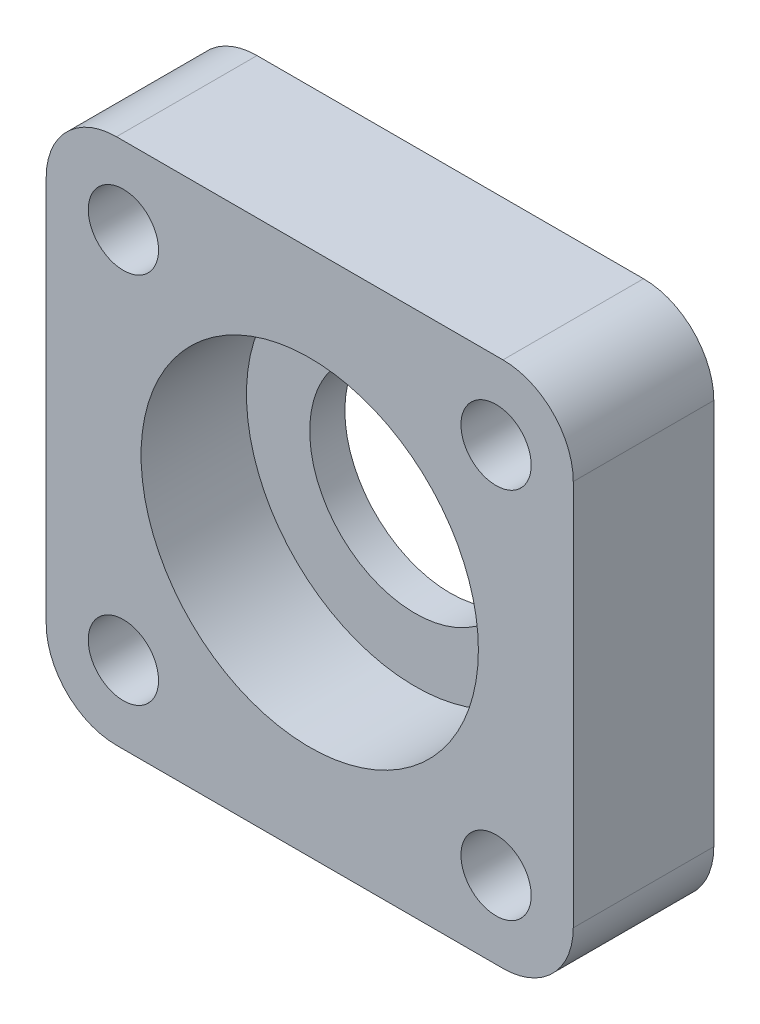
ISO-10303-21;
HEADER;
FILE_DESCRIPTION(('STEP AP214'),'2;1');
FILE_NAME('part.step','',(''),(''),'','','');
FILE_SCHEMA(('AUTOMOTIVE_DESIGN { 1 0 10303 214 1 1 1 1 }'));
ENDSEC;
DATA;
#1=APPLICATION_CONTEXT('core data for automotive mechanical design processes');
#2=APPLICATION_PROTOCOL_DEFINITION('international standard','automotive_design',2000,#1);
#3=PRODUCT_CONTEXT('',#1,'mechanical');
#4=PRODUCT('Part','Part','',(#3));
#5=PRODUCT_RELATED_PRODUCT_CATEGORY('part','',(#4));
#6=PRODUCT_DEFINITION_FORMATION('','',#4);
#7=PRODUCT_DEFINITION_CONTEXT('part definition',#1,'design');
#8=PRODUCT_DEFINITION('design','',#6,#7);
#9=PRODUCT_DEFINITION_SHAPE('','',#8);
#10=(LENGTH_UNIT() NAMED_UNIT(*) SI_UNIT(.MILLI.,.METRE.));
#11=(NAMED_UNIT(*) PLANE_ANGLE_UNIT() SI_UNIT($,.RADIAN.));
#12=(NAMED_UNIT(*) SI_UNIT($,.STERADIAN.) SOLID_ANGLE_UNIT());
#13=UNCERTAINTY_MEASURE_WITH_UNIT(LENGTH_MEASURE(1.E-05),#10,'distance_accuracy_value','');
#14=(GEOMETRIC_REPRESENTATION_CONTEXT(3) GLOBAL_UNCERTAINTY_ASSIGNED_CONTEXT((#13)) GLOBAL_UNIT_ASSIGNED_CONTEXT((#10,
#11,#12)) REPRESENTATION_CONTEXT('',''));
#15=CARTESIAN_POINT('',(0.,0.,0.));
#16=DIRECTION('',(0.,0.,1.));
#17=DIRECTION('',(1.,0.,0.));
#18=AXIS2_PLACEMENT_3D('',#15,#16,#17);
#19=CARTESIAN_POINT('',(0.,0.,8.));
#20=DIRECTION('',(0.,0.,-1.));
#21=DIRECTION('',(-1.,0.,0.));
#22=AXIS2_PLACEMENT_3D('',#19,#20,#21);
#23=PLANE('',#22);
#24=CARTESIAN_POINT('',(15.,15.,8.));
#25=DIRECTION('',(0.,0.,1.));
#26=DIRECTION('',(1.,0.,0.));
#27=AXIS2_PLACEMENT_3D('',#24,#25,#26);
#28=CIRCLE('',#27,9.6);
#29=CARTESIAN_POINT('',(24.6,15.,8.));
#30=VERTEX_POINT('',#29);
#31=EDGE_CURVE('E148',#30,#30,#28,.T.);
#32=ORIENTED_EDGE('',*,*,#31,.F.);
#33=EDGE_LOOP('',(#32));
#34=FACE_BOUND('',#33,.T.);
#35=DIRECTION('',(0.,-1.,0.));
#36=VECTOR('',#35,1.);
#37=CARTESIAN_POINT('',(0.,0.,8.));
#38=LINE('',#37,#36);
#39=CARTESIAN_POINT('',(0.,26.,8.));
#40=VERTEX_POINT('',#39);
#41=CARTESIAN_POINT('',(0.,4.,8.));
#42=VERTEX_POINT('',#41);
#43=EDGE_CURVE('E144',#40,#42,#38,.T.);
#44=ORIENTED_EDGE('',*,*,#43,.T.);
#45=CARTESIAN_POINT('',(4.,4.,8.));
#46=DIRECTION('',(0.,0.,-1.));
#47=DIRECTION('',(-1.,0.,0.));
#48=AXIS2_PLACEMENT_3D('',#45,#46,#47);
#49=CIRCLE('',#48,4.);
#50=CARTESIAN_POINT('',(4.,0.,8.));
#51=VERTEX_POINT('',#50);
#52=EDGE_CURVE('E164',#42,#51,#49,.F.);
#53=ORIENTED_EDGE('',*,*,#52,.T.);
#54=DIRECTION('',(1.,0.,0.));
#55=VECTOR('',#54,1.);
#56=CARTESIAN_POINT('',(0.,0.,8.));
#57=LINE('',#56,#55);
#58=CARTESIAN_POINT('',(26.,0.,8.));
#59=VERTEX_POINT('',#58);
#60=EDGE_CURVE('E126',#51,#59,#57,.T.);
#61=ORIENTED_EDGE('',*,*,#60,.T.);
#62=CARTESIAN_POINT('',(26.,4.,8.));
#63=DIRECTION('',(0.,0.,-1.));
#64=DIRECTION('',(-1.,0.,0.));
#65=AXIS2_PLACEMENT_3D('',#62,#63,#64);
#66=CIRCLE('',#65,4.);
#67=CARTESIAN_POINT('',(30.,4.,8.));
#68=VERTEX_POINT('',#67);
#69=EDGE_CURVE('E162',#59,#68,#66,.F.);
#70=ORIENTED_EDGE('',*,*,#69,.T.);
#71=DIRECTION('',(0.,1.,0.));
#72=VECTOR('',#71,1.);
#73=CARTESIAN_POINT('',(30.,0.,8.));
#74=LINE('',#73,#72);
#75=CARTESIAN_POINT('',(30.,26.,8.));
#76=VERTEX_POINT('',#75);
#77=EDGE_CURVE('E184',#68,#76,#74,.T.);
#78=ORIENTED_EDGE('',*,*,#77,.T.);
#79=CARTESIAN_POINT('',(26.,26.,8.));
#80=DIRECTION('',(0.,0.,-1.));
#81=DIRECTION('',(-1.,0.,0.));
#82=AXIS2_PLACEMENT_3D('',#79,#80,#81);
#83=CIRCLE('',#82,4.);
#84=CARTESIAN_POINT('',(26.,30.,8.));
#85=VERTEX_POINT('',#84);
#86=EDGE_CURVE('E61',#76,#85,#83,.F.);
#87=ORIENTED_EDGE('',*,*,#86,.T.);
#88=DIRECTION('',(-1.,0.,0.));
#89=VECTOR('',#88,1.);
#90=CARTESIAN_POINT('',(0.,30.,8.));
#91=LINE('',#90,#89);
#92=CARTESIAN_POINT('',(4.,30.,8.));
#93=VERTEX_POINT('',#92);
#94=EDGE_CURVE('E150',#85,#93,#91,.T.);
#95=ORIENTED_EDGE('',*,*,#94,.T.);
#96=CARTESIAN_POINT('',(4.,26.,8.));
#97=DIRECTION('',(0.,0.,-1.));
#98=DIRECTION('',(-1.,0.,0.));
#99=AXIS2_PLACEMENT_3D('',#96,#97,#98);
#100=CIRCLE('',#99,4.);
#101=EDGE_CURVE('E160',#93,#40,#100,.F.);
#102=ORIENTED_EDGE('',*,*,#101,.T.);
#103=EDGE_LOOP('',(#44,#53,#61,#70,#78,#87,#95,#102));
#104=FACE_BOUND('',#103,.T.);
#105=CARTESIAN_POINT('',(25.6066017177982,25.6066017177982,8.));
#106=DIRECTION('',(0.,0.,1.));
#107=DIRECTION('',(1.,0.,0.));
#108=AXIS2_PLACEMENT_3D('',#105,#106,#107);
#109=CIRCLE('',#108,2.);
#110=CARTESIAN_POINT('',(27.6066017177982,25.6066017177982,8.));
#111=VERTEX_POINT('',#110);
#112=EDGE_CURVE('E139',#111,#111,#109,.T.);
#113=ORIENTED_EDGE('',*,*,#112,.F.);
#114=EDGE_LOOP('',(#113));
#115=FACE_BOUND('',#114,.T.);
#116=CARTESIAN_POINT('',(25.6066017177982,4.39339828220181,8.));
#117=DIRECTION('',(0.,0.,1.));
#118=DIRECTION('',(1.,0.,0.));
#119=AXIS2_PLACEMENT_3D('',#116,#117,#118);
#120=CIRCLE('',#119,2.);
#121=CARTESIAN_POINT('',(27.6066017177982,4.39339828220181,8.));
#122=VERTEX_POINT('',#121);
#123=EDGE_CURVE('E200',#122,#122,#120,.T.);
#124=ORIENTED_EDGE('',*,*,#123,.F.);
#125=EDGE_LOOP('',(#124));
#126=FACE_BOUND('',#125,.T.);
#127=CARTESIAN_POINT('',(4.39339828220181,4.39339828220177,8.));
#128=DIRECTION('',(0.,0.,1.));
#129=DIRECTION('',(1.,0.,0.));
#130=AXIS2_PLACEMENT_3D('',#127,#128,#129);
#131=CIRCLE('',#130,2.00000000000001);
#132=CARTESIAN_POINT('',(6.39339828220182,4.39339828220177,8.));
#133=VERTEX_POINT('',#132);
#134=EDGE_CURVE('E204',#133,#133,#131,.T.);
#135=ORIENTED_EDGE('',*,*,#134,.F.);
#136=EDGE_LOOP('',(#135));
#137=FACE_BOUND('',#136,.T.);
#138=CARTESIAN_POINT('',(4.39339828220177,25.6066017177982,8.));
#139=DIRECTION('',(0.,0.,1.));
#140=DIRECTION('',(1.,0.,0.));
#141=AXIS2_PLACEMENT_3D('',#138,#139,#140);
#142=CIRCLE('',#141,2.00000000000001);
#143=CARTESIAN_POINT('',(6.39339828220178,25.6066017177982,8.));
#144=VERTEX_POINT('',#143);
#145=EDGE_CURVE('E207',#144,#144,#142,.T.);
#146=ORIENTED_EDGE('',*,*,#145,.F.);
#147=EDGE_LOOP('',(#146));
#148=FACE_BOUND('',#147,.T.);
#149=ADVANCED_FACE('F41',(#34,#104,#115,#126,#137,#148),#23,.F.);
#150=CARTESIAN_POINT('',(0.,0.,0.));
#151=DIRECTION('',(0.,0.,-1.));
#152=DIRECTION('',(-1.,0.,0.));
#153=AXIS2_PLACEMENT_3D('',#150,#151,#152);
#154=PLANE('',#153);
#155=CARTESIAN_POINT('',(15.,15.,0.));
#156=DIRECTION('',(0.,0.,-1.));
#157=DIRECTION('',(-1.,0.,0.));
#158=AXIS2_PLACEMENT_3D('',#155,#156,#157);
#159=CIRCLE('',#158,6.);
#160=CARTESIAN_POINT('',(9.,15.,0.));
#161=VERTEX_POINT('',#160);
#162=EDGE_CURVE('E145',#161,#161,#159,.T.);
#163=ORIENTED_EDGE('',*,*,#162,.F.);
#164=EDGE_LOOP('',(#163));
#165=FACE_BOUND('',#164,.T.);
#166=CARTESIAN_POINT('',(4.39339828220181,4.39339828220177,0.));
#167=DIRECTION('',(0.,0.,1.));
#168=DIRECTION('',(1.,0.,0.));
#169=AXIS2_PLACEMENT_3D('',#166,#167,#168);
#170=CIRCLE('',#169,2.00000000000001);
#171=CARTESIAN_POINT('',(6.39339828220182,4.39339828220177,0.));
#172=VERTEX_POINT('',#171);
#173=EDGE_CURVE('E209',#172,#172,#170,.T.);
#174=ORIENTED_EDGE('',*,*,#173,.T.);
#175=EDGE_LOOP('',(#174));
#176=FACE_BOUND('',#175,.T.);
#177=CARTESIAN_POINT('',(25.6066017177982,25.6066017177982,0.));
#178=DIRECTION('',(0.,0.,1.));
#179=DIRECTION('',(1.,0.,0.));
#180=AXIS2_PLACEMENT_3D('',#177,#178,#179);
#181=CIRCLE('',#180,2.);
#182=CARTESIAN_POINT('',(27.6066017177982,25.6066017177982,0.));
#183=VERTEX_POINT('',#182);
#184=EDGE_CURVE('E187',#183,#183,#181,.T.);
#185=ORIENTED_EDGE('',*,*,#184,.T.);
#186=EDGE_LOOP('',(#185));
#187=FACE_BOUND('',#186,.T.);
#188=DIRECTION('',(1.,0.,0.));
#189=VECTOR('',#188,1.);
#190=CARTESIAN_POINT('',(0.,0.,0.));
#191=LINE('',#190,#189);
#192=CARTESIAN_POINT('',(4.,0.,0.));
#193=VERTEX_POINT('',#192);
#194=CARTESIAN_POINT('',(26.,0.,0.));
#195=VERTEX_POINT('',#194);
#196=EDGE_CURVE('E123',#193,#195,#191,.T.);
#197=ORIENTED_EDGE('',*,*,#196,.F.);
#198=CARTESIAN_POINT('',(4.,4.,0.));
#199=DIRECTION('',(0.,0.,-1.));
#200=DIRECTION('',(-1.,0.,0.));
#201=AXIS2_PLACEMENT_3D('',#198,#199,#200);
#202=CIRCLE('',#201,4.);
#203=CARTESIAN_POINT('',(0.,4.,0.));
#204=VERTEX_POINT('',#203);
#205=EDGE_CURVE('E106',#193,#204,#202,.T.);
#206=ORIENTED_EDGE('',*,*,#205,.T.);
#207=DIRECTION('',(0.,-1.,0.));
#208=VECTOR('',#207,1.);
#209=CARTESIAN_POINT('',(0.,0.,0.));
#210=LINE('',#209,#208);
#211=CARTESIAN_POINT('',(0.,26.,0.));
#212=VERTEX_POINT('',#211);
#213=EDGE_CURVE('E134',#212,#204,#210,.T.);
#214=ORIENTED_EDGE('',*,*,#213,.F.);
#215=CARTESIAN_POINT('',(4.,26.,0.));
#216=DIRECTION('',(0.,0.,-1.));
#217=DIRECTION('',(-1.,0.,0.));
#218=AXIS2_PLACEMENT_3D('',#215,#216,#217);
#219=CIRCLE('',#218,4.);
#220=CARTESIAN_POINT('',(4.,30.,0.));
#221=VERTEX_POINT('',#220);
#222=EDGE_CURVE('E153',#212,#221,#219,.T.);
#223=ORIENTED_EDGE('',*,*,#222,.T.);
#224=DIRECTION('',(-1.,0.,0.));
#225=VECTOR('',#224,1.);
#226=CARTESIAN_POINT('',(0.,30.,0.));
#227=LINE('',#226,#225);
#228=CARTESIAN_POINT('',(26.,30.,0.));
#229=VERTEX_POINT('',#228);
#230=EDGE_CURVE('E137',#229,#221,#227,.T.);
#231=ORIENTED_EDGE('',*,*,#230,.F.);
#232=CARTESIAN_POINT('',(26.,26.,0.));
#233=DIRECTION('',(0.,0.,-1.));
#234=DIRECTION('',(-1.,0.,0.));
#235=AXIS2_PLACEMENT_3D('',#232,#233,#234);
#236=CIRCLE('',#235,4.);
#237=CARTESIAN_POINT('',(30.,26.,0.));
#238=VERTEX_POINT('',#237);
#239=EDGE_CURVE('E127',#229,#238,#236,.T.);
#240=ORIENTED_EDGE('',*,*,#239,.T.);
#241=DIRECTION('',(0.,1.,0.));
#242=VECTOR('',#241,1.);
#243=CARTESIAN_POINT('',(30.,0.,0.));
#244=LINE('',#243,#242);
#245=CARTESIAN_POINT('',(30.,4.,0.));
#246=VERTEX_POINT('',#245);
#247=EDGE_CURVE('E133',#246,#238,#244,.T.);
#248=ORIENTED_EDGE('',*,*,#247,.F.);
#249=CARTESIAN_POINT('',(26.,4.,0.));
#250=DIRECTION('',(0.,0.,-1.));
#251=DIRECTION('',(-1.,0.,0.));
#252=AXIS2_PLACEMENT_3D('',#249,#250,#251);
#253=CIRCLE('',#252,4.);
#254=EDGE_CURVE('E117',#246,#195,#253,.T.);
#255=ORIENTED_EDGE('',*,*,#254,.T.);
#256=EDGE_LOOP('',(#197,#206,#214,#223,#231,#240,#248,#255));
#257=FACE_BOUND('',#256,.T.);
#258=CARTESIAN_POINT('',(25.6066017177982,4.39339828220181,0.));
#259=DIRECTION('',(0.,0.,1.));
#260=DIRECTION('',(1.,0.,0.));
#261=AXIS2_PLACEMENT_3D('',#258,#259,#260);
#262=CIRCLE('',#261,2.);
#263=CARTESIAN_POINT('',(27.6066017177982,4.39339828220181,0.));
#264=VERTEX_POINT('',#263);
#265=EDGE_CURVE('E220',#264,#264,#262,.T.);
#266=ORIENTED_EDGE('',*,*,#265,.T.);
#267=EDGE_LOOP('',(#266));
#268=FACE_BOUND('',#267,.T.);
#269=CARTESIAN_POINT('',(4.39339828220177,25.6066017177982,0.));
#270=DIRECTION('',(0.,0.,1.));
#271=DIRECTION('',(1.,0.,0.));
#272=AXIS2_PLACEMENT_3D('',#269,#270,#271);
#273=CIRCLE('',#272,2.00000000000001);
#274=CARTESIAN_POINT('',(6.39339828220178,25.6066017177982,0.));
#275=VERTEX_POINT('',#274);
#276=EDGE_CURVE('E210',#275,#275,#273,.T.);
#277=ORIENTED_EDGE('',*,*,#276,.T.);
#278=EDGE_LOOP('',(#277));
#279=FACE_BOUND('',#278,.T.);
#280=ADVANCED_FACE('F130',(#165,#176,#187,#257,#268,#279),#154,.T.);
#281=CARTESIAN_POINT('',(0.,0.,8.));
#282=DIRECTION('',(1.,0.,0.));
#283=DIRECTION('',(0.,0.,-1.));
#284=AXIS2_PLACEMENT_3D('',#281,#282,#283);
#285=PLANE('',#284);
#286=ORIENTED_EDGE('',*,*,#213,.T.);
#287=DIRECTION('',(0.,0.,-1.));
#288=VECTOR('',#287,1.);
#289=CARTESIAN_POINT('',(0.,4.,8.));
#290=LINE('',#289,#288);
#291=EDGE_CURVE('E111',#204,#42,#290,.F.);
#292=ORIENTED_EDGE('',*,*,#291,.T.);
#293=ORIENTED_EDGE('',*,*,#43,.F.);
#294=DIRECTION('',(0.,0.,-1.));
#295=VECTOR('',#294,1.);
#296=CARTESIAN_POINT('',(0.,26.,8.));
#297=LINE('',#296,#295);
#298=EDGE_CURVE('E116',#40,#212,#297,.T.);
#299=ORIENTED_EDGE('',*,*,#298,.T.);
#300=EDGE_LOOP('',(#286,#292,#293,#299));
#301=FACE_BOUND('',#300,.T.);
#302=ADVANCED_FACE('F181',(#301),#285,.F.);
#303=CARTESIAN_POINT('',(0.,0.,8.));
#304=DIRECTION('',(0.,1.,0.));
#305=DIRECTION('',(0.,0.,1.));
#306=AXIS2_PLACEMENT_3D('',#303,#304,#305);
#307=PLANE('',#306);
#308=ORIENTED_EDGE('',*,*,#60,.F.);
#309=DIRECTION('',(0.,0.,-1.));
#310=VECTOR('',#309,1.);
#311=CARTESIAN_POINT('',(4.,0.,8.));
#312=LINE('',#311,#310);
#313=EDGE_CURVE('E110',#51,#193,#312,.T.);
#314=ORIENTED_EDGE('',*,*,#313,.T.);
#315=ORIENTED_EDGE('',*,*,#196,.T.);
#316=DIRECTION('',(0.,0.,-1.));
#317=VECTOR('',#316,1.);
#318=CARTESIAN_POINT('',(26.,0.,8.));
#319=LINE('',#318,#317);
#320=EDGE_CURVE('E128',#195,#59,#319,.F.);
#321=ORIENTED_EDGE('',*,*,#320,.T.);
#322=EDGE_LOOP('',(#308,#314,#315,#321));
#323=FACE_BOUND('',#322,.T.);
#324=ADVANCED_FACE('F122',(#323),#307,.F.);
#325=CARTESIAN_POINT('',(30.,0.,8.));
#326=DIRECTION('',(-1.,0.,0.));
#327=DIRECTION('',(0.,0.,1.));
#328=AXIS2_PLACEMENT_3D('',#325,#326,#327);
#329=PLANE('',#328);
#330=ORIENTED_EDGE('',*,*,#77,.F.);
#331=DIRECTION('',(0.,0.,-1.));
#332=VECTOR('',#331,1.);
#333=CARTESIAN_POINT('',(30.,4.,8.));
#334=LINE('',#333,#332);
#335=EDGE_CURVE('E168',#68,#246,#334,.T.);
#336=ORIENTED_EDGE('',*,*,#335,.T.);
#337=ORIENTED_EDGE('',*,*,#247,.T.);
#338=DIRECTION('',(0.,0.,-1.));
#339=VECTOR('',#338,1.);
#340=CARTESIAN_POINT('',(30.,26.,8.));
#341=LINE('',#340,#339);
#342=EDGE_CURVE('E166',#238,#76,#341,.F.);
#343=ORIENTED_EDGE('',*,*,#342,.T.);
#344=EDGE_LOOP('',(#330,#336,#337,#343));
#345=FACE_BOUND('',#344,.T.);
#346=ADVANCED_FACE('F240',(#345),#329,.F.);
#347=CARTESIAN_POINT('',(0.,30.,8.));
#348=DIRECTION('',(0.,-1.,0.));
#349=DIRECTION('',(0.,0.,-1.));
#350=AXIS2_PLACEMENT_3D('',#347,#348,#349);
#351=PLANE('',#350);
#352=ORIENTED_EDGE('',*,*,#230,.T.);
#353=DIRECTION('',(0.,0.,-1.));
#354=VECTOR('',#353,1.);
#355=CARTESIAN_POINT('',(4.,30.,8.));
#356=LINE('',#355,#354);
#357=EDGE_CURVE('E11',#221,#93,#356,.F.);
#358=ORIENTED_EDGE('',*,*,#357,.T.);
#359=ORIENTED_EDGE('',*,*,#94,.F.);
#360=DIRECTION('',(0.,0.,-1.));
#361=VECTOR('',#360,1.);
#362=CARTESIAN_POINT('',(26.,30.,8.));
#363=LINE('',#362,#361);
#364=EDGE_CURVE('E49',#85,#229,#363,.T.);
#365=ORIENTED_EDGE('',*,*,#364,.T.);
#366=EDGE_LOOP('',(#352,#358,#359,#365));
#367=FACE_BOUND('',#366,.T.);
#368=ADVANCED_FACE('F173',(#367),#351,.F.);
#369=CARTESIAN_POINT('',(25.6066017177982,25.6066017177982,8.));
#370=DIRECTION('',(0.,0.,-1.));
#371=DIRECTION('',(-1.,0.,0.));
#372=AXIS2_PLACEMENT_3D('',#369,#370,#371);
#373=CYLINDRICAL_SURFACE('',#372,2.);
#374=ORIENTED_EDGE('',*,*,#112,.T.);
#375=EDGE_LOOP('',(#374));
#376=FACE_BOUND('',#375,.T.);
#377=ORIENTED_EDGE('',*,*,#184,.F.);
#378=EDGE_LOOP('',(#377));
#379=FACE_BOUND('',#378,.T.);
#380=ADVANCED_FACE('F229',(#376,#379),#373,.F.);
#381=CARTESIAN_POINT('',(25.6066017177982,4.39339828220181,8.));
#382=DIRECTION('',(0.,0.,-1.));
#383=DIRECTION('',(-1.,0.,0.));
#384=AXIS2_PLACEMENT_3D('',#381,#382,#383);
#385=CYLINDRICAL_SURFACE('',#384,2.);
#386=ORIENTED_EDGE('',*,*,#123,.T.);
#387=EDGE_LOOP('',(#386));
#388=FACE_BOUND('',#387,.T.);
#389=ORIENTED_EDGE('',*,*,#265,.F.);
#390=EDGE_LOOP('',(#389));
#391=FACE_BOUND('',#390,.T.);
#392=ADVANCED_FACE('F231',(#388,#391),#385,.F.);
#393=CARTESIAN_POINT('',(4.39339828220181,4.39339828220177,8.));
#394=DIRECTION('',(0.,0.,-1.));
#395=DIRECTION('',(-1.,0.,0.));
#396=AXIS2_PLACEMENT_3D('',#393,#394,#395);
#397=CYLINDRICAL_SURFACE('',#396,2.00000000000001);
#398=ORIENTED_EDGE('',*,*,#134,.T.);
#399=EDGE_LOOP('',(#398));
#400=FACE_BOUND('',#399,.T.);
#401=ORIENTED_EDGE('',*,*,#173,.F.);
#402=EDGE_LOOP('',(#401));
#403=FACE_BOUND('',#402,.T.);
#404=ADVANCED_FACE('F237',(#400,#403),#397,.F.);
#405=CARTESIAN_POINT('',(4.39339828220177,25.6066017177982,8.));
#406=DIRECTION('',(0.,0.,-1.));
#407=DIRECTION('',(-1.,0.,0.));
#408=AXIS2_PLACEMENT_3D('',#405,#406,#407);
#409=CYLINDRICAL_SURFACE('',#408,2.00000000000001);
#410=ORIENTED_EDGE('',*,*,#145,.T.);
#411=EDGE_LOOP('',(#410));
#412=FACE_BOUND('',#411,.T.);
#413=ORIENTED_EDGE('',*,*,#276,.F.);
#414=EDGE_LOOP('',(#413));
#415=FACE_BOUND('',#414,.T.);
#416=ADVANCED_FACE('F364',(#412,#415),#409,.F.);
#417=CARTESIAN_POINT('',(15.,15.,2.));
#418=DIRECTION('',(0.,0.,1.));
#419=DIRECTION('',(1.,0.,0.));
#420=AXIS2_PLACEMENT_3D('',#417,#418,#419);
#421=CYLINDRICAL_SURFACE('',#420,9.6);
#422=CARTESIAN_POINT('',(15.,15.,2.));
#423=DIRECTION('',(0.,0.,1.));
#424=DIRECTION('',(1.,0.,0.));
#425=AXIS2_PLACEMENT_3D('',#422,#423,#424);
#426=CIRCLE('',#425,9.6);
#427=CARTESIAN_POINT('',(24.6,15.,2.));
#428=VERTEX_POINT('',#427);
#429=EDGE_CURVE('E215',#428,#428,#426,.T.);
#430=ORIENTED_EDGE('',*,*,#429,.F.);
#431=EDGE_LOOP('',(#430));
#432=FACE_BOUND('',#431,.T.);
#433=ORIENTED_EDGE('',*,*,#31,.T.);
#434=EDGE_LOOP('',(#433));
#435=FACE_BOUND('',#434,.T.);
#436=ADVANCED_FACE('F353',(#432,#435),#421,.F.);
#437=CARTESIAN_POINT('',(15.,15.,2.));
#438=DIRECTION('',(0.,0.,1.));
#439=DIRECTION('',(1.,0.,0.));
#440=AXIS2_PLACEMENT_3D('',#437,#438,#439);
#441=PLANE('',#440);
#442=CARTESIAN_POINT('',(15.,15.,2.));
#443=DIRECTION('',(0.,0.,1.));
#444=DIRECTION('',(1.,0.,0.));
#445=AXIS2_PLACEMENT_3D('',#442,#443,#444);
#446=CIRCLE('',#445,6.);
#447=CARTESIAN_POINT('',(21.,15.,2.));
#448=VERTEX_POINT('',#447);
#449=EDGE_CURVE('E149',#448,#448,#446,.T.);
#450=ORIENTED_EDGE('',*,*,#449,.F.);
#451=EDGE_LOOP('',(#450));
#452=FACE_BOUND('',#451,.T.);
#453=ORIENTED_EDGE('',*,*,#429,.T.);
#454=EDGE_LOOP('',(#453));
#455=FACE_BOUND('',#454,.T.);
#456=ADVANCED_FACE('F342',(#452,#455),#441,.T.);
#457=CARTESIAN_POINT('',(15.,15.,-5.));
#458=DIRECTION('',(0.,0.,1.));
#459=DIRECTION('',(1.,0.,0.));
#460=AXIS2_PLACEMENT_3D('',#457,#458,#459);
#461=CYLINDRICAL_SURFACE('',#460,6.);
#462=ORIENTED_EDGE('',*,*,#162,.T.);
#463=EDGE_LOOP('',(#462));
#464=FACE_BOUND('',#463,.T.);
#465=ORIENTED_EDGE('',*,*,#449,.T.);
#466=EDGE_LOOP('',(#465));
#467=FACE_BOUND('',#466,.T.);
#468=ADVANCED_FACE('F257',(#464,#467),#461,.F.);
#469=CARTESIAN_POINT('',(4.,4.,8.));
#470=DIRECTION('',(0.,0.,-1.));
#471=DIRECTION('',(-1.,0.,0.));
#472=AXIS2_PLACEMENT_3D('',#469,#470,#471);
#473=CYLINDRICAL_SURFACE('',#472,4.);
#474=ORIENTED_EDGE('',*,*,#52,.F.);
#475=ORIENTED_EDGE('',*,*,#291,.F.);
#476=ORIENTED_EDGE('',*,*,#205,.F.);
#477=ORIENTED_EDGE('',*,*,#313,.F.);
#478=EDGE_LOOP('',(#474,#475,#476,#477));
#479=FACE_BOUND('',#478,.T.);
#480=ADVANCED_FACE('F109',(#479),#473,.T.);
#481=CARTESIAN_POINT('',(26.,4.,8.));
#482=DIRECTION('',(0.,0.,-1.));
#483=DIRECTION('',(-1.,0.,0.));
#484=AXIS2_PLACEMENT_3D('',#481,#482,#483);
#485=CYLINDRICAL_SURFACE('',#484,4.);
#486=ORIENTED_EDGE('',*,*,#69,.F.);
#487=ORIENTED_EDGE('',*,*,#320,.F.);
#488=ORIENTED_EDGE('',*,*,#254,.F.);
#489=ORIENTED_EDGE('',*,*,#335,.F.);
#490=EDGE_LOOP('',(#486,#487,#488,#489));
#491=FACE_BOUND('',#490,.T.);
#492=ADVANCED_FACE('F256',(#491),#485,.T.);
#493=CARTESIAN_POINT('',(4.,26.,8.));
#494=DIRECTION('',(0.,0.,-1.));
#495=DIRECTION('',(-1.,0.,0.));
#496=AXIS2_PLACEMENT_3D('',#493,#494,#495);
#497=CYLINDRICAL_SURFACE('',#496,4.);
#498=ORIENTED_EDGE('',*,*,#101,.F.);
#499=ORIENTED_EDGE('',*,*,#357,.F.);
#500=ORIENTED_EDGE('',*,*,#222,.F.);
#501=ORIENTED_EDGE('',*,*,#298,.F.);
#502=EDGE_LOOP('',(#498,#499,#500,#501));
#503=FACE_BOUND('',#502,.T.);
#504=ADVANCED_FACE('F178',(#503),#497,.T.);
#505=CARTESIAN_POINT('',(26.,26.,8.));
#506=DIRECTION('',(0.,0.,-1.));
#507=DIRECTION('',(-1.,0.,0.));
#508=AXIS2_PLACEMENT_3D('',#505,#506,#507);
#509=CYLINDRICAL_SURFACE('',#508,4.);
#510=ORIENTED_EDGE('',*,*,#86,.F.);
#511=ORIENTED_EDGE('',*,*,#342,.F.);
#512=ORIENTED_EDGE('',*,*,#239,.F.);
#513=ORIENTED_EDGE('',*,*,#364,.F.);
#514=EDGE_LOOP('',(#510,#511,#512,#513));
#515=FACE_BOUND('',#514,.T.);
#516=ADVANCED_FACE('F43',(#515),#509,.T.);
#517=CLOSED_SHELL('',(#149,#280,#302,#324,#346,#368,#380,#392,#404,#416,#436,#456,#468,#480,
#492,#504,#516));
#518=MANIFOLD_SOLID_BREP('B2',#517);
#519=ADVANCED_BREP_SHAPE_REPRESENTATION('',(#18,#518),#14);
#520=SHAPE_DEFINITION_REPRESENTATION(#9,#519);
ENDSEC;
END-ISO-10303-21;
